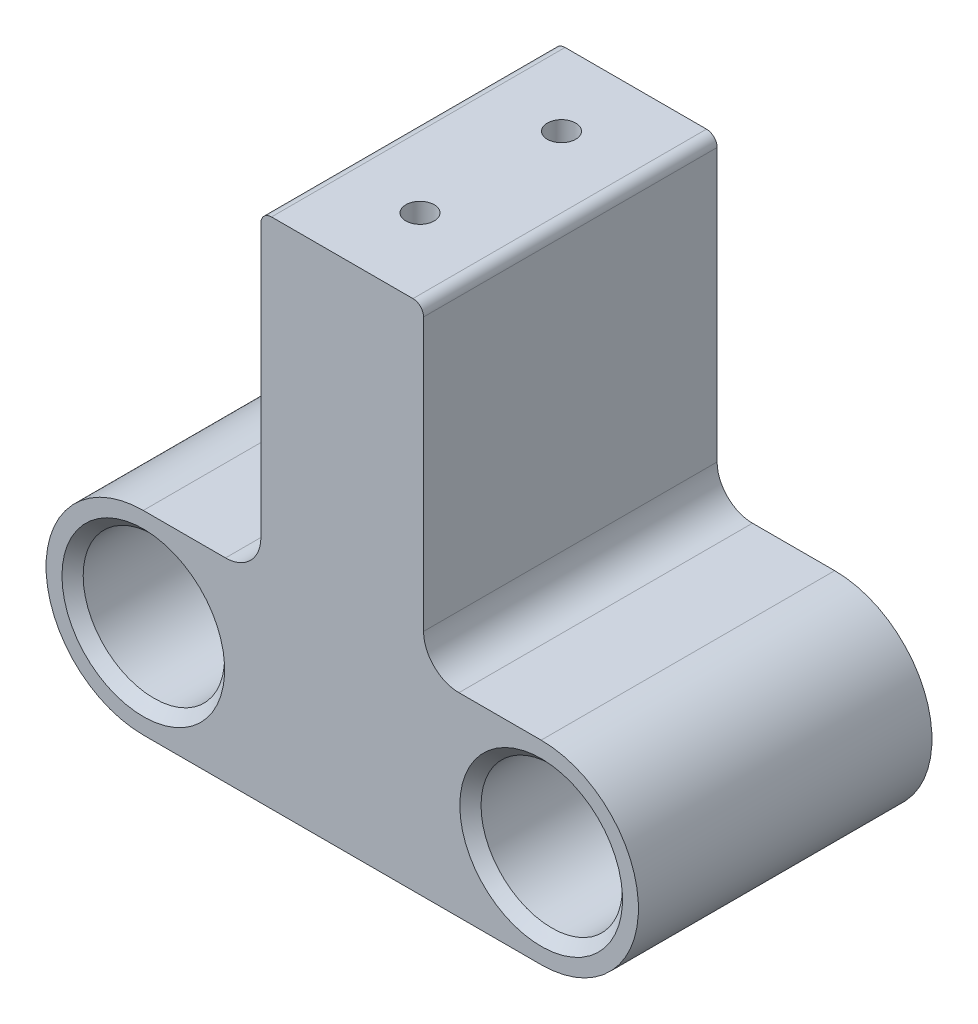
ISO-10303-21;
HEADER;
FILE_DESCRIPTION(('STEP AP214'),'2;1');
FILE_NAME('part.step','',(''),(''),'','','');
FILE_SCHEMA(('AUTOMOTIVE_DESIGN { 1 0 10303 214 1 1 1 1 }'));
ENDSEC;
DATA;
#1=APPLICATION_CONTEXT('core data for automotive mechanical design processes');
#2=APPLICATION_PROTOCOL_DEFINITION('international standard','automotive_design',2000,#1);
#3=PRODUCT_CONTEXT('',#1,'mechanical');
#4=PRODUCT('Part','Part','',(#3));
#5=PRODUCT_RELATED_PRODUCT_CATEGORY('part','',(#4));
#6=PRODUCT_DEFINITION_FORMATION('','',#4);
#7=PRODUCT_DEFINITION_CONTEXT('part definition',#1,'design');
#8=PRODUCT_DEFINITION('design','',#6,#7);
#9=PRODUCT_DEFINITION_SHAPE('','',#8);
#10=(LENGTH_UNIT() NAMED_UNIT(*) SI_UNIT(.MILLI.,.METRE.));
#11=(NAMED_UNIT(*) PLANE_ANGLE_UNIT() SI_UNIT($,.RADIAN.));
#12=(NAMED_UNIT(*) SI_UNIT($,.STERADIAN.) SOLID_ANGLE_UNIT());
#13=UNCERTAINTY_MEASURE_WITH_UNIT(LENGTH_MEASURE(1.E-05),#10,'distance_accuracy_value','');
#14=(GEOMETRIC_REPRESENTATION_CONTEXT(3) GLOBAL_UNCERTAINTY_ASSIGNED_CONTEXT((#13)) GLOBAL_UNIT_ASSIGNED_CONTEXT((#10,
#11,#12)) REPRESENTATION_CONTEXT('',''));
#15=CARTESIAN_POINT('',(0.,0.,0.));
#16=DIRECTION('',(0.,0.,1.));
#17=DIRECTION('',(1.,0.,0.));
#18=AXIS2_PLACEMENT_3D('',#15,#16,#17);
#19=CARTESIAN_POINT('',(0.,0.,0.));
#20=DIRECTION('',(0.,0.,-1.));
#21=DIRECTION('',(-1.,0.,0.));
#22=AXIS2_PLACEMENT_3D('',#19,#20,#21);
#23=PLANE('',#22);
#24=CARTESIAN_POINT('',(-14.2875,-11.176,0.));
#25=DIRECTION('',(0.,0.,1.));
#26=DIRECTION('',(1.,0.,0.));
#27=AXIS2_PLACEMENT_3D('',#24,#25,#26);
#28=CIRCLE('',#27,3.37819999999999);
#29=CARTESIAN_POINT('',(-10.9093,-11.176,0.));
#30=VERTEX_POINT('',#29);
#31=EDGE_CURVE('E177',#30,#30,#28,.T.);
#32=ORIENTED_EDGE('',*,*,#31,.T.);
#33=EDGE_LOOP('',(#32));
#34=FACE_BOUND('',#33,.T.);
#35=CARTESIAN_POINT('',(14.2875,-11.176,0.));
#36=DIRECTION('',(0.,0.,1.));
#37=DIRECTION('',(1.,0.,0.));
#38=AXIS2_PLACEMENT_3D('',#35,#36,#37);
#39=CIRCLE('',#38,3.3782);
#40=CARTESIAN_POINT('',(17.6657,-11.176,0.));
#41=VERTEX_POINT('',#40);
#42=EDGE_CURVE('E180',#41,#41,#39,.T.);
#43=ORIENTED_EDGE('',*,*,#42,.T.);
#44=EDGE_LOOP('',(#43));
#45=FACE_BOUND('',#44,.T.);
#46=DIRECTION('',(-1.,0.,0.));
#47=VECTOR('',#46,1.);
#48=CARTESIAN_POINT('',(0.,-4.19099999999999,0.));
#49=LINE('',#48,#47);
#50=CARTESIAN_POINT('',(14.2875,-4.19099999999998,0.));
#51=VERTEX_POINT('',#50);
#52=CARTESIAN_POINT('',(8.38200000000001,-4.19099999999999,0.));
#53=VERTEX_POINT('',#52);
#54=EDGE_CURVE('E155',#51,#53,#49,.T.);
#55=ORIENTED_EDGE('',*,*,#54,.F.);
#56=CARTESIAN_POINT('',(14.2875,-11.176,0.));
#57=DIRECTION('',(0.,0.,1.));
#58=DIRECTION('',(1.,0.,0.));
#59=AXIS2_PLACEMENT_3D('',#56,#57,#58);
#60=CIRCLE('',#59,6.98500000000002);
#61=CARTESIAN_POINT('',(14.2875,-18.161,0.));
#62=VERTEX_POINT('',#61);
#63=EDGE_CURVE('E136',#62,#51,#60,.T.);
#64=ORIENTED_EDGE('',*,*,#63,.F.);
#65=DIRECTION('',(1.,0.,0.));
#66=VECTOR('',#65,1.);
#67=CARTESIAN_POINT('',(14.2875,-18.161,0.));
#68=LINE('',#67,#66);
#69=CARTESIAN_POINT('',(-14.2875,-18.161,0.));
#70=VERTEX_POINT('',#69);
#71=EDGE_CURVE('E142',#70,#62,#68,.T.);
#72=ORIENTED_EDGE('',*,*,#71,.F.);
#73=CARTESIAN_POINT('',(-14.2875,-11.176,0.));
#74=DIRECTION('',(0.,0.,1.));
#75=DIRECTION('',(1.,0.,0.));
#76=AXIS2_PLACEMENT_3D('',#73,#74,#75);
#77=CIRCLE('',#76,6.98500000000001);
#78=CARTESIAN_POINT('',(-14.2875,-4.19099999999999,0.));
#79=VERTEX_POINT('',#78);
#80=EDGE_CURVE('E127',#79,#70,#77,.T.);
#81=ORIENTED_EDGE('',*,*,#80,.F.);
#82=DIRECTION('',(1.,0.,0.));
#83=VECTOR('',#82,1.);
#84=CARTESIAN_POINT('',(0.,-4.19099999999999,0.));
#85=LINE('',#84,#83);
#86=CARTESIAN_POINT('',(-8.382,-4.19099999999999,0.));
#87=VERTEX_POINT('',#86);
#88=EDGE_CURVE('E139',#79,#87,#85,.T.);
#89=ORIENTED_EDGE('',*,*,#88,.T.);
#90=CARTESIAN_POINT('',(-8.382,-1.65099999999999,0.));
#91=DIRECTION('',(0.,0.,-1.));
#92=DIRECTION('',(-1.,0.,0.));
#93=AXIS2_PLACEMENT_3D('',#90,#91,#92);
#94=CIRCLE('',#93,2.54);
#95=CARTESIAN_POINT('',(-5.842,-1.65099999999999,0.));
#96=VERTEX_POINT('',#95);
#97=EDGE_CURVE('E44',#87,#96,#94,.F.);
#98=ORIENTED_EDGE('',*,*,#97,.T.);
#99=DIRECTION('',(0.,-1.,0.));
#100=VECTOR('',#99,1.);
#101=CARTESIAN_POINT('',(-5.842,18.669,0.));
#102=LINE('',#101,#100);
#103=CARTESIAN_POINT('',(-5.842,17.907,0.));
#104=VERTEX_POINT('',#103);
#105=EDGE_CURVE('E188',#104,#96,#102,.T.);
#106=ORIENTED_EDGE('',*,*,#105,.F.);
#107=CARTESIAN_POINT('',(-5.08,17.907,0.));
#108=DIRECTION('',(0.,0.,-1.));
#109=DIRECTION('',(-1.,0.,0.));
#110=AXIS2_PLACEMENT_3D('',#107,#108,#109);
#111=CIRCLE('',#110,0.762);
#112=CARTESIAN_POINT('',(-5.08,18.669,0.));
#113=VERTEX_POINT('',#112);
#114=EDGE_CURVE('E196',#104,#113,#111,.T.);
#115=ORIENTED_EDGE('',*,*,#114,.T.);
#116=DIRECTION('',(-1.,0.,0.));
#117=VECTOR('',#116,1.);
#118=CARTESIAN_POINT('',(-5.842,18.669,0.));
#119=LINE('',#118,#117);
#120=CARTESIAN_POINT('',(5.08,18.669,0.));
#121=VERTEX_POINT('',#120);
#122=EDGE_CURVE('E185',#121,#113,#119,.T.);
#123=ORIENTED_EDGE('',*,*,#122,.F.);
#124=CARTESIAN_POINT('',(5.08,17.907,0.));
#125=DIRECTION('',(0.,0.,-1.));
#126=DIRECTION('',(-1.,0.,0.));
#127=AXIS2_PLACEMENT_3D('',#124,#125,#126);
#128=CIRCLE('',#127,0.762);
#129=CARTESIAN_POINT('',(5.842,17.907,0.));
#130=VERTEX_POINT('',#129);
#131=EDGE_CURVE('E198',#121,#130,#128,.T.);
#132=ORIENTED_EDGE('',*,*,#131,.T.);
#133=DIRECTION('',(0.,1.,0.));
#134=VECTOR('',#133,1.);
#135=CARTESIAN_POINT('',(5.842,18.669,0.));
#136=LINE('',#135,#134);
#137=CARTESIAN_POINT('',(5.842,-1.65099999999999,0.));
#138=VERTEX_POINT('',#137);
#139=EDGE_CURVE('E183',#138,#130,#136,.T.);
#140=ORIENTED_EDGE('',*,*,#139,.F.);
#141=CARTESIAN_POINT('',(8.382,-1.65099999999999,0.));
#142=DIRECTION('',(0.,0.,-1.));
#143=DIRECTION('',(-1.,0.,0.));
#144=AXIS2_PLACEMENT_3D('',#141,#142,#143);
#145=CIRCLE('',#144,2.54);
#146=EDGE_CURVE('E236',#138,#53,#145,.F.);
#147=ORIENTED_EDGE('',*,*,#146,.T.);
#148=EDGE_LOOP('',(#55,#64,#72,#81,#89,#98,#106,#115,#123,#132,#140,#147));
#149=FACE_BOUND('',#148,.T.);
#150=ADVANCED_FACE('F36',(#34,#45,#149),#23,.T.);
#151=CARTESIAN_POINT('',(0.,-20.701,5.334));
#152=DIRECTION('',(0.,1.,0.));
#153=DIRECTION('',(0.,0.,1.));
#154=AXIS2_PLACEMENT_3D('',#151,#152,#153);
#155=CYLINDRICAL_SURFACE('',#154,1.016);
#156=CARTESIAN_POINT('',(0.,18.669,5.334));
#157=DIRECTION('',(0.,1.,0.));
#158=DIRECTION('',(0.,0.,1.));
#159=AXIS2_PLACEMENT_3D('',#156,#157,#158);
#160=CIRCLE('',#159,1.016);
#161=CARTESIAN_POINT('',(0.,18.669,6.35));
#162=VERTEX_POINT('',#161);
#163=EDGE_CURVE('E174',#162,#162,#160,.T.);
#164=ORIENTED_EDGE('',*,*,#163,.T.);
#165=EDGE_LOOP('',(#164));
#166=FACE_BOUND('',#165,.T.);
#167=CARTESIAN_POINT('',(0.,-18.161,5.334));
#168=DIRECTION('',(0.,-1.,0.));
#169=DIRECTION('',(1.,0.,0.));
#170=AXIS2_PLACEMENT_3D('',#167,#168,#169);
#171=CIRCLE('',#170,1.016);
#172=CARTESIAN_POINT('',(1.016,-18.161,5.334));
#173=VERTEX_POINT('',#172);
#174=EDGE_CURVE('E384',#173,#173,#171,.F.);
#175=ORIENTED_EDGE('',*,*,#174,.F.);
#176=EDGE_LOOP('',(#175));
#177=FACE_BOUND('',#176,.T.);
#178=ADVANCED_FACE('F278',(#166,#177),#155,.F.);
#179=CARTESIAN_POINT('',(0.,-20.701,15.494));
#180=DIRECTION('',(0.,1.,0.));
#181=DIRECTION('',(0.,0.,1.));
#182=AXIS2_PLACEMENT_3D('',#179,#180,#181);
#183=CYLINDRICAL_SURFACE('',#182,1.016);
#184=CARTESIAN_POINT('',(0.,18.669,15.494));
#185=DIRECTION('',(0.,1.,0.));
#186=DIRECTION('',(0.,0.,-1.));
#187=AXIS2_PLACEMENT_3D('',#184,#185,#186);
#188=CIRCLE('',#187,1.016);
#189=CARTESIAN_POINT('',(0.,18.669,14.478));
#190=VERTEX_POINT('',#189);
#191=EDGE_CURVE('E171',#190,#190,#188,.T.);
#192=ORIENTED_EDGE('',*,*,#191,.T.);
#193=EDGE_LOOP('',(#192));
#194=FACE_BOUND('',#193,.T.);
#195=CARTESIAN_POINT('',(0.,-18.161,15.494));
#196=DIRECTION('',(0.,-1.,0.));
#197=DIRECTION('',(1.,0.,0.));
#198=AXIS2_PLACEMENT_3D('',#195,#196,#197);
#199=CIRCLE('',#198,1.016);
#200=CARTESIAN_POINT('',(1.016,-18.161,15.494));
#201=VERTEX_POINT('',#200);
#202=EDGE_CURVE('E379',#201,#201,#199,.F.);
#203=ORIENTED_EDGE('',*,*,#202,.F.);
#204=EDGE_LOOP('',(#203));
#205=FACE_BOUND('',#204,.T.);
#206=ADVANCED_FACE('F284',(#194,#205),#183,.F.);
#207=CARTESIAN_POINT('',(-32.2349402231044,-20.701,21.082));
#208=DIRECTION('',(0.,0.,-1.));
#209=DIRECTION('',(-1.,0.,0.));
#210=AXIS2_PLACEMENT_3D('',#207,#208,#209);
#211=PLANE('',#210);
#212=CARTESIAN_POINT('',(-14.2875,-11.176,21.082));
#213=DIRECTION('',(0.,0.,-1.));
#214=DIRECTION('',(-1.,0.,0.));
#215=AXIS2_PLACEMENT_3D('',#212,#213,#214);
#216=CIRCLE('',#215,5.842);
#217=CARTESIAN_POINT('',(-20.1295,-11.176,21.082));
#218=VERTEX_POINT('',#217);
#219=EDGE_CURVE('E218',#218,#218,#216,.T.);
#220=ORIENTED_EDGE('',*,*,#219,.T.);
#221=EDGE_LOOP('',(#220));
#222=FACE_BOUND('',#221,.T.);
#223=CARTESIAN_POINT('',(14.2875,-11.176,21.082));
#224=DIRECTION('',(0.,0.,-1.));
#225=DIRECTION('',(-1.,0.,0.));
#226=AXIS2_PLACEMENT_3D('',#223,#224,#225);
#227=CIRCLE('',#226,5.84199999999999);
#228=CARTESIAN_POINT('',(8.44550000000001,-11.176,21.082));
#229=VERTEX_POINT('',#228);
#230=EDGE_CURVE('E221',#229,#229,#227,.T.);
#231=ORIENTED_EDGE('',*,*,#230,.T.);
#232=EDGE_LOOP('',(#231));
#233=FACE_BOUND('',#232,.T.);
#234=CARTESIAN_POINT('',(14.2875,-11.176,21.082));
#235=DIRECTION('',(0.,0.,1.));
#236=DIRECTION('',(1.,0.,0.));
#237=AXIS2_PLACEMENT_3D('',#234,#235,#236);
#238=CIRCLE('',#237,6.98500000000002);
#239=CARTESIAN_POINT('',(14.2875,-18.161,21.082));
#240=VERTEX_POINT('',#239);
#241=CARTESIAN_POINT('',(14.2875,-4.19099999999998,21.082));
#242=VERTEX_POINT('',#241);
#243=EDGE_CURVE('E143',#240,#242,#238,.T.);
#244=ORIENTED_EDGE('',*,*,#243,.T.);
#245=DIRECTION('',(-1.,0.,0.));
#246=VECTOR('',#245,1.);
#247=CARTESIAN_POINT('',(-32.2349402231044,-4.191,21.082));
#248=LINE('',#247,#246);
#249=CARTESIAN_POINT('',(8.38200000000001,-4.19099999999999,21.082));
#250=VERTEX_POINT('',#249);
#251=EDGE_CURVE('E249',#242,#250,#248,.T.);
#252=ORIENTED_EDGE('',*,*,#251,.T.);
#253=CARTESIAN_POINT('',(8.382,-1.65099999999999,21.082));
#254=DIRECTION('',(0.,0.,-1.));
#255=DIRECTION('',(-1.,0.,0.));
#256=AXIS2_PLACEMENT_3D('',#253,#254,#255);
#257=CIRCLE('',#256,2.54);
#258=CARTESIAN_POINT('',(5.842,-1.65099999999999,21.082));
#259=VERTEX_POINT('',#258);
#260=EDGE_CURVE('E234',#250,#259,#257,.T.);
#261=ORIENTED_EDGE('',*,*,#260,.T.);
#262=DIRECTION('',(0.,-1.,0.));
#263=VECTOR('',#262,1.);
#264=CARTESIAN_POINT('',(5.842,18.669,21.082));
#265=LINE('',#264,#263);
#266=CARTESIAN_POINT('',(5.842,17.907,21.082));
#267=VERTEX_POINT('',#266);
#268=EDGE_CURVE('E166',#267,#259,#265,.T.);
#269=ORIENTED_EDGE('',*,*,#268,.F.);
#270=CARTESIAN_POINT('',(5.08,17.907,21.082));
#271=DIRECTION('',(0.,0.,-1.));
#272=DIRECTION('',(-1.,0.,0.));
#273=AXIS2_PLACEMENT_3D('',#270,#271,#272);
#274=CIRCLE('',#273,0.762);
#275=CARTESIAN_POINT('',(5.08,18.669,21.082));
#276=VERTEX_POINT('',#275);
#277=EDGE_CURVE('E206',#267,#276,#274,.F.);
#278=ORIENTED_EDGE('',*,*,#277,.T.);
#279=DIRECTION('',(-1.,0.,0.));
#280=VECTOR('',#279,1.);
#281=CARTESIAN_POINT('',(-32.2349402231044,18.669,21.082));
#282=LINE('',#281,#280);
#283=CARTESIAN_POINT('',(-5.08,18.669,21.082));
#284=VERTEX_POINT('',#283);
#285=EDGE_CURVE('E163',#276,#284,#282,.T.);
#286=ORIENTED_EDGE('',*,*,#285,.T.);
#287=CARTESIAN_POINT('',(-5.08,17.907,21.082));
#288=DIRECTION('',(0.,0.,-1.));
#289=DIRECTION('',(-1.,0.,0.));
#290=AXIS2_PLACEMENT_3D('',#287,#288,#289);
#291=CIRCLE('',#290,0.762);
#292=CARTESIAN_POINT('',(-5.842,17.907,21.082));
#293=VERTEX_POINT('',#292);
#294=EDGE_CURVE('E203',#284,#293,#291,.F.);
#295=ORIENTED_EDGE('',*,*,#294,.T.);
#296=DIRECTION('',(0.,1.,0.));
#297=VECTOR('',#296,1.);
#298=CARTESIAN_POINT('',(-5.842,18.669,21.082));
#299=LINE('',#298,#297);
#300=CARTESIAN_POINT('',(-5.842,-1.65099999999999,21.082));
#301=VERTEX_POINT('',#300);
#302=EDGE_CURVE('E169',#301,#293,#299,.T.);
#303=ORIENTED_EDGE('',*,*,#302,.F.);
#304=CARTESIAN_POINT('',(-8.382,-1.65099999999999,21.082));
#305=DIRECTION('',(0.,0.,-1.));
#306=DIRECTION('',(-1.,0.,0.));
#307=AXIS2_PLACEMENT_3D('',#304,#305,#306);
#308=CIRCLE('',#307,2.54);
#309=CARTESIAN_POINT('',(-8.38199999999999,-4.19099999999999,21.082));
#310=VERTEX_POINT('',#309);
#311=EDGE_CURVE('E12',#301,#310,#308,.T.);
#312=ORIENTED_EDGE('',*,*,#311,.T.);
#313=DIRECTION('',(1.,0.,0.));
#314=VECTOR('',#313,1.);
#315=CARTESIAN_POINT('',(-32.2349402231044,-4.191,21.082));
#316=LINE('',#315,#314);
#317=CARTESIAN_POINT('',(-14.2875,-4.19099999999999,21.082));
#318=VERTEX_POINT('',#317);
#319=EDGE_CURVE('E150',#318,#310,#316,.T.);
#320=ORIENTED_EDGE('',*,*,#319,.F.);
#321=CARTESIAN_POINT('',(-14.2875,-11.176,21.082));
#322=DIRECTION('',(0.,0.,1.));
#323=DIRECTION('',(1.,0.,0.));
#324=AXIS2_PLACEMENT_3D('',#321,#322,#323);
#325=CIRCLE('',#324,6.98500000000001);
#326=CARTESIAN_POINT('',(-14.2875,-18.161,21.082));
#327=VERTEX_POINT('',#326);
#328=EDGE_CURVE('E130',#318,#327,#325,.T.);
#329=ORIENTED_EDGE('',*,*,#328,.T.);
#330=DIRECTION('',(1.,0.,0.));
#331=VECTOR('',#330,1.);
#332=CARTESIAN_POINT('',(14.2875,-18.161,21.082));
#333=LINE('',#332,#331);
#334=EDGE_CURVE('E370',#327,#240,#333,.T.);
#335=ORIENTED_EDGE('',*,*,#334,.T.);
#336=EDGE_LOOP('',(#244,#252,#261,#269,#278,#286,#295,#303,#312,#320,#329,#335));
#337=FACE_BOUND('',#336,.T.);
#338=ADVANCED_FACE('F254',(#222,#233,#337),#211,.F.);
#339=CARTESIAN_POINT('',(0.,-4.19099999999999,0.));
#340=DIRECTION('',(0.,1.,0.));
#341=DIRECTION('',(-1.,0.,0.));
#342=AXIS2_PLACEMENT_3D('',#339,#340,#341);
#343=PLANE('',#342);
#344=ORIENTED_EDGE('',*,*,#319,.T.);
#345=DIRECTION('',(0.,0.,-1.));
#346=VECTOR('',#345,1.);
#347=CARTESIAN_POINT('',(-8.382,-4.19099999999999,0.));
#348=LINE('',#347,#346);
#349=EDGE_CURVE('E148',#310,#87,#348,.T.);
#350=ORIENTED_EDGE('',*,*,#349,.T.);
#351=ORIENTED_EDGE('',*,*,#88,.F.);
#352=DIRECTION('',(0.,0.,1.));
#353=VECTOR('',#352,1.);
#354=CARTESIAN_POINT('',(-14.2875,-4.19099999999999,0.));
#355=LINE('',#354,#353);
#356=EDGE_CURVE('E124',#79,#318,#355,.T.);
#357=ORIENTED_EDGE('',*,*,#356,.T.);
#358=EDGE_LOOP('',(#344,#350,#351,#357));
#359=FACE_BOUND('',#358,.T.);
#360=ADVANCED_FACE('F146',(#359),#343,.T.);
#361=CARTESIAN_POINT('',(0.,-4.19099999999999,0.));
#362=DIRECTION('',(0.,-1.,0.));
#363=DIRECTION('',(1.,0.,0.));
#364=AXIS2_PLACEMENT_3D('',#361,#362,#363);
#365=PLANE('',#364);
#366=ORIENTED_EDGE('',*,*,#54,.T.);
#367=DIRECTION('',(0.,0.,1.));
#368=VECTOR('',#367,1.);
#369=CARTESIAN_POINT('',(8.38200000000001,-4.19099999999999,21.082));
#370=LINE('',#369,#368);
#371=EDGE_CURVE('E227',#53,#250,#370,.T.);
#372=ORIENTED_EDGE('',*,*,#371,.T.);
#373=ORIENTED_EDGE('',*,*,#251,.F.);
#374=DIRECTION('',(0.,0.,1.));
#375=VECTOR('',#374,1.);
#376=CARTESIAN_POINT('',(14.2875,-4.19099999999998,0.));
#377=LINE('',#376,#375);
#378=EDGE_CURVE('E248',#51,#242,#377,.T.);
#379=ORIENTED_EDGE('',*,*,#378,.F.);
#380=EDGE_LOOP('',(#366,#372,#373,#379));
#381=FACE_BOUND('',#380,.T.);
#382=ADVANCED_FACE('F245',(#381),#365,.F.);
#383=CARTESIAN_POINT('',(-14.2875,-11.176,25.4));
#384=DIRECTION('',(0.,0.,1.));
#385=DIRECTION('',(1.,0.,0.));
#386=AXIS2_PLACEMENT_3D('',#383,#384,#385);
#387=CYLINDRICAL_SURFACE('',#386,3.37819999999999);
#388=ORIENTED_EDGE('',*,*,#31,.F.);
#389=EDGE_LOOP('',(#388));
#390=FACE_BOUND('',#389,.T.);
#391=CARTESIAN_POINT('',(-14.2875,-11.176,9.52500000000001));
#392=DIRECTION('',(0.,0.,1.));
#393=DIRECTION('',(1.,0.,0.));
#394=AXIS2_PLACEMENT_3D('',#391,#392,#393);
#395=CIRCLE('',#394,3.37819999999999);
#396=CARTESIAN_POINT('',(-10.9093,-11.176,9.52500000000001));
#397=VERTEX_POINT('',#396);
#398=EDGE_CURVE('E153',#397,#397,#395,.F.);
#399=ORIENTED_EDGE('',*,*,#398,.F.);
#400=EDGE_LOOP('',(#399));
#401=FACE_BOUND('',#400,.T.);
#402=ADVANCED_FACE('F336',(#390,#401),#387,.F.);
#403=CARTESIAN_POINT('',(14.2875,-11.176,25.4));
#404=DIRECTION('',(0.,0.,1.));
#405=DIRECTION('',(1.,0.,0.));
#406=AXIS2_PLACEMENT_3D('',#403,#404,#405);
#407=CYLINDRICAL_SURFACE('',#406,3.37819999999999);
#408=ORIENTED_EDGE('',*,*,#42,.F.);
#409=EDGE_LOOP('',(#408));
#410=FACE_BOUND('',#409,.T.);
#411=CARTESIAN_POINT('',(14.2875,-11.176,9.52500000000001));
#412=DIRECTION('',(0.,0.,1.));
#413=DIRECTION('',(1.,0.,0.));
#414=AXIS2_PLACEMENT_3D('',#411,#412,#413);
#415=CIRCLE('',#414,3.37819999999999);
#416=CARTESIAN_POINT('',(17.6657,-11.176,9.52500000000001));
#417=VERTEX_POINT('',#416);
#418=EDGE_CURVE('E162',#417,#417,#415,.F.);
#419=ORIENTED_EDGE('',*,*,#418,.F.);
#420=EDGE_LOOP('',(#419));
#421=FACE_BOUND('',#420,.T.);
#422=ADVANCED_FACE('F290',(#410,#421),#407,.F.);
#423=CARTESIAN_POINT('',(5.842,18.669,25.4));
#424=DIRECTION('',(-1.,0.,0.));
#425=DIRECTION('',(0.,-1.,0.));
#426=AXIS2_PLACEMENT_3D('',#423,#424,#425);
#427=PLANE('',#426);
#428=ORIENTED_EDGE('',*,*,#268,.T.);
#429=DIRECTION('',(0.,0.,1.));
#430=VECTOR('',#429,1.);
#431=CARTESIAN_POINT('',(5.842,-1.65099999999999,0.));
#432=LINE('',#431,#430);
#433=EDGE_CURVE('E230',#259,#138,#432,.F.);
#434=ORIENTED_EDGE('',*,*,#433,.T.);
#435=ORIENTED_EDGE('',*,*,#139,.T.);
#436=DIRECTION('',(0.,0.,-1.));
#437=VECTOR('',#436,1.);
#438=CARTESIAN_POINT('',(5.842,17.907,25.4));
#439=LINE('',#438,#437);
#440=EDGE_CURVE('E201',#130,#267,#439,.F.);
#441=ORIENTED_EDGE('',*,*,#440,.T.);
#442=EDGE_LOOP('',(#428,#434,#435,#441));
#443=FACE_BOUND('',#442,.T.);
#444=ADVANCED_FACE('F257',(#443),#427,.F.);
#445=CARTESIAN_POINT('',(-5.842,18.669,25.4));
#446=DIRECTION('',(0.,-1.,0.));
#447=DIRECTION('',(0.,0.,-1.));
#448=AXIS2_PLACEMENT_3D('',#445,#446,#447);
#449=PLANE('',#448);
#450=ORIENTED_EDGE('',*,*,#191,.F.);
#451=EDGE_LOOP('',(#450));
#452=FACE_BOUND('',#451,.T.);
#453=ORIENTED_EDGE('',*,*,#163,.F.);
#454=EDGE_LOOP('',(#453));
#455=FACE_BOUND('',#454,.T.);
#456=ORIENTED_EDGE('',*,*,#285,.F.);
#457=DIRECTION('',(0.,0.,-1.));
#458=VECTOR('',#457,1.);
#459=CARTESIAN_POINT('',(5.08,18.669,25.4));
#460=LINE('',#459,#458);
#461=EDGE_CURVE('E193',#276,#121,#460,.T.);
#462=ORIENTED_EDGE('',*,*,#461,.T.);
#463=ORIENTED_EDGE('',*,*,#122,.T.);
#464=DIRECTION('',(0.,0.,-1.));
#465=VECTOR('',#464,1.);
#466=CARTESIAN_POINT('',(-5.08,18.669,25.4));
#467=LINE('',#466,#465);
#468=EDGE_CURVE('E191',#113,#284,#467,.F.);
#469=ORIENTED_EDGE('',*,*,#468,.T.);
#470=EDGE_LOOP('',(#456,#462,#463,#469));
#471=FACE_BOUND('',#470,.T.);
#472=ADVANCED_FACE('F265',(#452,#455,#471),#449,.F.);
#473=CARTESIAN_POINT('',(-5.842,18.669,25.4));
#474=DIRECTION('',(1.,0.,0.));
#475=DIRECTION('',(0.,1.,0.));
#476=AXIS2_PLACEMENT_3D('',#473,#474,#475);
#477=PLANE('',#476);
#478=ORIENTED_EDGE('',*,*,#105,.T.);
#479=DIRECTION('',(0.,0.,-1.));
#480=VECTOR('',#479,1.);
#481=CARTESIAN_POINT('',(-5.842,-1.65099999999999,25.4));
#482=LINE('',#481,#480);
#483=EDGE_CURVE('E57',#96,#301,#482,.F.);
#484=ORIENTED_EDGE('',*,*,#483,.T.);
#485=ORIENTED_EDGE('',*,*,#302,.T.);
#486=DIRECTION('',(0.,0.,-1.));
#487=VECTOR('',#486,1.);
#488=CARTESIAN_POINT('',(-5.842,17.907,25.4));
#489=LINE('',#488,#487);
#490=EDGE_CURVE('E208',#293,#104,#489,.T.);
#491=ORIENTED_EDGE('',*,*,#490,.T.);
#492=EDGE_LOOP('',(#478,#484,#485,#491));
#493=FACE_BOUND('',#492,.T.);
#494=ADVANCED_FACE('F292',(#493),#477,.F.);
#495=CARTESIAN_POINT('',(5.08,17.907,25.4));
#496=DIRECTION('',(0.,0.,-1.));
#497=DIRECTION('',(-1.,0.,0.));
#498=AXIS2_PLACEMENT_3D('',#495,#496,#497);
#499=CYLINDRICAL_SURFACE('',#498,0.762);
#500=ORIENTED_EDGE('',*,*,#277,.F.);
#501=ORIENTED_EDGE('',*,*,#440,.F.);
#502=ORIENTED_EDGE('',*,*,#131,.F.);
#503=ORIENTED_EDGE('',*,*,#461,.F.);
#504=EDGE_LOOP('',(#500,#501,#502,#503));
#505=FACE_BOUND('',#504,.T.);
#506=ADVANCED_FACE('F260',(#505),#499,.T.);
#507=CARTESIAN_POINT('',(-5.08,17.907,25.4));
#508=DIRECTION('',(0.,0.,-1.));
#509=DIRECTION('',(-1.,0.,0.));
#510=AXIS2_PLACEMENT_3D('',#507,#508,#509);
#511=CYLINDRICAL_SURFACE('',#510,0.762);
#512=ORIENTED_EDGE('',*,*,#294,.F.);
#513=ORIENTED_EDGE('',*,*,#468,.F.);
#514=ORIENTED_EDGE('',*,*,#114,.F.);
#515=ORIENTED_EDGE('',*,*,#490,.F.);
#516=EDGE_LOOP('',(#512,#513,#514,#515));
#517=FACE_BOUND('',#516,.T.);
#518=ADVANCED_FACE('F269',(#517),#511,.T.);
#519=CARTESIAN_POINT('',(-28.575,-20.701,9.525));
#520=DIRECTION('',(0.,0.,1.));
#521=DIRECTION('',(1.,0.,0.));
#522=AXIS2_PLACEMENT_3D('',#519,#520,#521);
#523=PLANE('',#522);
#524=CARTESIAN_POINT('',(14.2875,-11.176,9.52500000000001));
#525=DIRECTION('',(0.,0.,1.));
#526=DIRECTION('',(1.,0.,0.));
#527=AXIS2_PLACEMENT_3D('',#524,#525,#526);
#528=CIRCLE('',#527,5.08);
#529=CARTESIAN_POINT('',(19.3675,-11.176,9.52500000000001));
#530=VERTEX_POINT('',#529);
#531=EDGE_CURVE('E159',#530,#530,#528,.F.);
#532=ORIENTED_EDGE('',*,*,#531,.F.);
#533=EDGE_LOOP('',(#532));
#534=FACE_BOUND('',#533,.T.);
#535=ORIENTED_EDGE('',*,*,#418,.T.);
#536=EDGE_LOOP('',(#535));
#537=FACE_BOUND('',#536,.T.);
#538=ADVANCED_FACE('F304',(#534,#537),#523,.T.);
#539=CARTESIAN_POINT('',(14.2875,-11.176,-14.3684097937106));
#540=DIRECTION('',(0.,0.,1.));
#541=DIRECTION('',(1.,0.,0.));
#542=AXIS2_PLACEMENT_3D('',#539,#540,#541);
#543=CYLINDRICAL_SURFACE('',#542,5.08);
#544=CARTESIAN_POINT('',(14.2875,-11.176,20.32));
#545=DIRECTION('',(0.,0.,-1.));
#546=DIRECTION('',(-1.,0.,0.));
#547=AXIS2_PLACEMENT_3D('',#544,#545,#546);
#548=CIRCLE('',#547,5.08);
#549=CARTESIAN_POINT('',(9.2075,-11.176,20.32));
#550=VERTEX_POINT('',#549);
#551=EDGE_CURVE('E211',#550,#550,#548,.F.);
#552=ORIENTED_EDGE('',*,*,#551,.T.);
#553=EDGE_LOOP('',(#552));
#554=FACE_BOUND('',#553,.T.);
#555=ORIENTED_EDGE('',*,*,#531,.T.);
#556=EDGE_LOOP('',(#555));
#557=FACE_BOUND('',#556,.T.);
#558=ADVANCED_FACE('F332',(#554,#557),#543,.F.);
#559=CARTESIAN_POINT('',(-28.575,-20.701,9.525));
#560=DIRECTION('',(0.,0.,1.));
#561=DIRECTION('',(1.,0.,0.));
#562=AXIS2_PLACEMENT_3D('',#559,#560,#561);
#563=PLANE('',#562);
#564=CARTESIAN_POINT('',(-14.2875,-11.176,9.52500000000001));
#565=DIRECTION('',(0.,0.,1.));
#566=DIRECTION('',(1.,0.,0.));
#567=AXIS2_PLACEMENT_3D('',#564,#565,#566);
#568=CIRCLE('',#567,5.08);
#569=CARTESIAN_POINT('',(-9.2075,-11.176,9.52500000000001));
#570=VERTEX_POINT('',#569);
#571=EDGE_CURVE('E149',#570,#570,#568,.F.);
#572=ORIENTED_EDGE('',*,*,#571,.F.);
#573=EDGE_LOOP('',(#572));
#574=FACE_BOUND('',#573,.T.);
#575=ORIENTED_EDGE('',*,*,#398,.T.);
#576=EDGE_LOOP('',(#575));
#577=FACE_BOUND('',#576,.T.);
#578=ADVANCED_FACE('F326',(#574,#577),#563,.T.);
#579=CARTESIAN_POINT('',(-14.2875,-11.176,-14.3684097937106));
#580=DIRECTION('',(0.,0.,1.));
#581=DIRECTION('',(1.,0.,0.));
#582=AXIS2_PLACEMENT_3D('',#579,#580,#581);
#583=CYLINDRICAL_SURFACE('',#582,5.08);
#584=CARTESIAN_POINT('',(-14.2875,-11.176,20.32));
#585=DIRECTION('',(0.,0.,-1.));
#586=DIRECTION('',(-1.,0.,0.));
#587=AXIS2_PLACEMENT_3D('',#584,#585,#586);
#588=CIRCLE('',#587,5.08);
#589=CARTESIAN_POINT('',(-19.3675,-11.176,20.32));
#590=VERTEX_POINT('',#589);
#591=EDGE_CURVE('E224',#590,#590,#588,.F.);
#592=ORIENTED_EDGE('',*,*,#591,.T.);
#593=EDGE_LOOP('',(#592));
#594=FACE_BOUND('',#593,.T.);
#595=ORIENTED_EDGE('',*,*,#571,.T.);
#596=EDGE_LOOP('',(#595));
#597=FACE_BOUND('',#596,.T.);
#598=ADVANCED_FACE('F309',(#594,#597),#583,.F.);
#599=CARTESIAN_POINT('',(14.2875,-11.176,20.32));
#600=DIRECTION('',(0.,0.,1.));
#601=DIRECTION('',(1.,0.,0.));
#602=AXIS2_PLACEMENT_3D('',#599,#600,#601);
#603=CONICAL_SURFACE('',#602,5.08,0.785398163397458);
#604=ORIENTED_EDGE('',*,*,#230,.F.);
#605=EDGE_LOOP('',(#604));
#606=FACE_BOUND('',#605,.T.);
#607=ORIENTED_EDGE('',*,*,#551,.F.);
#608=EDGE_LOOP('',(#607));
#609=FACE_BOUND('',#608,.T.);
#610=ADVANCED_FACE('F305',(#606,#609),#603,.F.);
#611=CARTESIAN_POINT('',(-14.2875,-11.176,20.32));
#612=DIRECTION('',(0.,0.,1.));
#613=DIRECTION('',(1.,0.,0.));
#614=AXIS2_PLACEMENT_3D('',#611,#612,#613);
#615=CONICAL_SURFACE('',#614,5.08,0.785398163397448);
#616=ORIENTED_EDGE('',*,*,#219,.F.);
#617=EDGE_LOOP('',(#616));
#618=FACE_BOUND('',#617,.T.);
#619=ORIENTED_EDGE('',*,*,#591,.F.);
#620=EDGE_LOOP('',(#619));
#621=FACE_BOUND('',#620,.T.);
#622=ADVANCED_FACE('F308',(#618,#621),#615,.F.);
#623=CARTESIAN_POINT('',(14.2875,-18.161,0.));
#624=DIRECTION('',(0.,-1.,0.));
#625=DIRECTION('',(1.,0.,0.));
#626=AXIS2_PLACEMENT_3D('',#623,#624,#625);
#627=PLANE('',#626);
#628=ORIENTED_EDGE('',*,*,#202,.T.);
#629=EDGE_LOOP('',(#628));
#630=FACE_BOUND('',#629,.T.);
#631=ORIENTED_EDGE('',*,*,#334,.F.);
#632=DIRECTION('',(0.,0.,1.));
#633=VECTOR('',#632,1.);
#634=CARTESIAN_POINT('',(-14.2875,-18.161,0.));
#635=LINE('',#634,#633);
#636=EDGE_CURVE('E135',#70,#327,#635,.T.);
#637=ORIENTED_EDGE('',*,*,#636,.F.);
#638=ORIENTED_EDGE('',*,*,#71,.T.);
#639=DIRECTION('',(0.,0.,1.));
#640=VECTOR('',#639,1.);
#641=CARTESIAN_POINT('',(14.2875,-18.161,0.));
#642=LINE('',#641,#640);
#643=EDGE_CURVE('E369',#62,#240,#642,.T.);
#644=ORIENTED_EDGE('',*,*,#643,.T.);
#645=EDGE_LOOP('',(#631,#637,#638,#644));
#646=FACE_BOUND('',#645,.T.);
#647=ORIENTED_EDGE('',*,*,#174,.T.);
#648=EDGE_LOOP('',(#647));
#649=FACE_BOUND('',#648,.T.);
#650=ADVANCED_FACE('F312',(#630,#646,#649),#627,.T.);
#651=CARTESIAN_POINT('',(14.2875,-11.176,0.));
#652=DIRECTION('',(0.,0.,1.));
#653=DIRECTION('',(1.,0.,0.));
#654=AXIS2_PLACEMENT_3D('',#651,#652,#653);
#655=CYLINDRICAL_SURFACE('',#654,6.98500000000002);
#656=ORIENTED_EDGE('',*,*,#243,.F.);
#657=ORIENTED_EDGE('',*,*,#643,.F.);
#658=ORIENTED_EDGE('',*,*,#63,.T.);
#659=ORIENTED_EDGE('',*,*,#378,.T.);
#660=EDGE_LOOP('',(#656,#657,#658,#659));
#661=FACE_BOUND('',#660,.T.);
#662=ADVANCED_FACE('F317',(#661),#655,.T.);
#663=CARTESIAN_POINT('',(-14.2875,-11.176,0.));
#664=DIRECTION('',(0.,0.,1.));
#665=DIRECTION('',(1.,0.,0.));
#666=AXIS2_PLACEMENT_3D('',#663,#664,#665);
#667=CYLINDRICAL_SURFACE('',#666,6.98500000000001);
#668=ORIENTED_EDGE('',*,*,#328,.F.);
#669=ORIENTED_EDGE('',*,*,#356,.F.);
#670=ORIENTED_EDGE('',*,*,#80,.T.);
#671=ORIENTED_EDGE('',*,*,#636,.T.);
#672=EDGE_LOOP('',(#668,#669,#670,#671));
#673=FACE_BOUND('',#672,.T.);
#674=ADVANCED_FACE('F126',(#673),#667,.T.);
#675=CARTESIAN_POINT('',(8.382,-1.65099999999999,0.));
#676=DIRECTION('',(0.,0.,-1.));
#677=DIRECTION('',(0.,1.,0.));
#678=AXIS2_PLACEMENT_3D('',#675,#676,#677);
#679=CYLINDRICAL_SURFACE('',#678,2.54);
#680=ORIENTED_EDGE('',*,*,#146,.F.);
#681=ORIENTED_EDGE('',*,*,#433,.F.);
#682=ORIENTED_EDGE('',*,*,#260,.F.);
#683=ORIENTED_EDGE('',*,*,#371,.F.);
#684=EDGE_LOOP('',(#680,#681,#682,#683));
#685=FACE_BOUND('',#684,.T.);
#686=ADVANCED_FACE('F250',(#685),#679,.F.);
#687=CARTESIAN_POINT('',(-8.382,-1.65099999999999,0.));
#688=DIRECTION('',(0.,0.,-1.));
#689=DIRECTION('',(-1.,0.,0.));
#690=AXIS2_PLACEMENT_3D('',#687,#688,#689);
#691=CYLINDRICAL_SURFACE('',#690,2.54);
#692=ORIENTED_EDGE('',*,*,#311,.F.);
#693=ORIENTED_EDGE('',*,*,#483,.F.);
#694=ORIENTED_EDGE('',*,*,#97,.F.);
#695=ORIENTED_EDGE('',*,*,#349,.F.);
#696=EDGE_LOOP('',(#692,#693,#694,#695));
#697=FACE_BOUND('',#696,.T.);
#698=ADVANCED_FACE('F38',(#697),#691,.F.);
#699=CLOSED_SHELL('',(#150,#178,#206,#338,#360,#382,#402,#422,#444,#472,#494,#506,#518,#538,
#558,#578,#598,#610,#622,#650,#662,#674,#686,#698));
#700=MANIFOLD_SOLID_BREP('B2',#699);
#701=ADVANCED_BREP_SHAPE_REPRESENTATION('',(#18,#700),#14);
#702=SHAPE_DEFINITION_REPRESENTATION(#9,#701);
ENDSEC;
END-ISO-10303-21;
